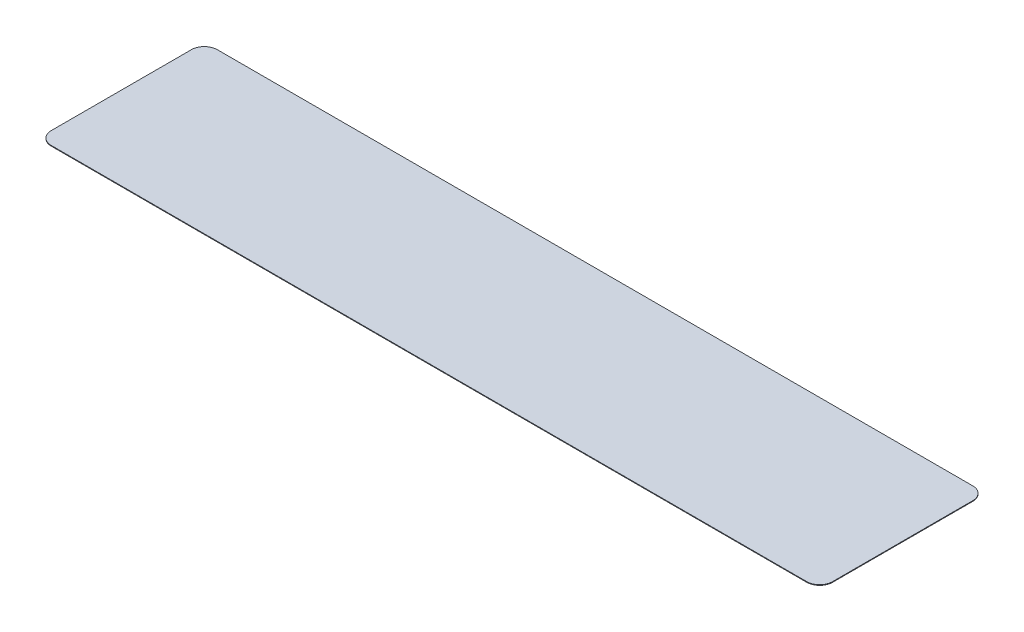
ISO-10303-21;
HEADER;
FILE_DESCRIPTION(('STEP AP214'),'2;1');
FILE_NAME('part.step','',(''),(''),'','','');
FILE_SCHEMA(('AUTOMOTIVE_DESIGN { 1 0 10303 214 1 1 1 1 }'));
ENDSEC;
DATA;
#1=APPLICATION_CONTEXT('core data for automotive mechanical design processes');
#2=APPLICATION_PROTOCOL_DEFINITION('international standard','automotive_design',2000,#1);
#3=PRODUCT_CONTEXT('',#1,'mechanical');
#4=PRODUCT('Part','Part','',(#3));
#5=PRODUCT_RELATED_PRODUCT_CATEGORY('part','',(#4));
#6=PRODUCT_DEFINITION_FORMATION('','',#4);
#7=PRODUCT_DEFINITION_CONTEXT('part definition',#1,'design');
#8=PRODUCT_DEFINITION('design','',#6,#7);
#9=PRODUCT_DEFINITION_SHAPE('','',#8);
#10=(LENGTH_UNIT() NAMED_UNIT(*) SI_UNIT(.MILLI.,.METRE.));
#11=(NAMED_UNIT(*) PLANE_ANGLE_UNIT() SI_UNIT($,.RADIAN.));
#12=(NAMED_UNIT(*) SI_UNIT($,.STERADIAN.) SOLID_ANGLE_UNIT());
#13=UNCERTAINTY_MEASURE_WITH_UNIT(LENGTH_MEASURE(1.E-05),#10,'distance_accuracy_value','');
#14=(GEOMETRIC_REPRESENTATION_CONTEXT(3) GLOBAL_UNCERTAINTY_ASSIGNED_CONTEXT((#13)) GLOBAL_UNIT_ASSIGNED_CONTEXT((#10,
#11,#12)) REPRESENTATION_CONTEXT('',''));
#15=CARTESIAN_POINT('',(0.,0.,0.));
#16=DIRECTION('',(0.,0.,1.));
#17=DIRECTION('',(1.,0.,0.));
#18=AXIS2_PLACEMENT_3D('',#15,#16,#17);
#19=CARTESIAN_POINT('',(-44.5135,0.0762,-8.25499999999998));
#20=DIRECTION('',(0.,-1.,0.));
#21=DIRECTION('',(0.,0.,-1.));
#22=AXIS2_PLACEMENT_3D('',#19,#20,#21);
#23=CYLINDRICAL_SURFACE('',#22,1.52399999999999);
#24=CARTESIAN_POINT('',(-44.5135,0.,-8.25499999999998));
#25=DIRECTION('',(0.,1.,0.));
#26=DIRECTION('',(0.,0.,1.));
#27=AXIS2_PLACEMENT_3D('',#24,#25,#26);
#28=CIRCLE('',#27,1.52399999999999);
#29=CARTESIAN_POINT('',(-44.5135,0.,-9.77899999999998));
#30=VERTEX_POINT('',#29);
#31=CARTESIAN_POINT('',(-46.0375,0.,-8.25499999999998));
#32=VERTEX_POINT('',#31);
#33=EDGE_CURVE('E128',#30,#32,#28,.T.);
#34=ORIENTED_EDGE('',*,*,#33,.T.);
#35=DIRECTION('',(0.,-1.,0.));
#36=VECTOR('',#35,1.);
#37=CARTESIAN_POINT('',(-46.0375,0.0762,-8.25499999999998));
#38=LINE('',#37,#36);
#39=CARTESIAN_POINT('',(-46.0375,0.0762,-8.25499999999998));
#40=VERTEX_POINT('',#39);
#41=EDGE_CURVE('E11',#40,#32,#38,.T.);
#42=ORIENTED_EDGE('',*,*,#41,.F.);
#43=CARTESIAN_POINT('',(-44.5135,0.0762,-8.25499999999998));
#44=DIRECTION('',(0.,1.,0.));
#45=DIRECTION('',(0.,0.,1.));
#46=AXIS2_PLACEMENT_3D('',#43,#44,#45);
#47=CIRCLE('',#46,1.52399999999999);
#48=CARTESIAN_POINT('',(-44.5135,0.0762,-9.77899999999998));
#49=VERTEX_POINT('',#48);
#50=EDGE_CURVE('E142',#49,#40,#47,.T.);
#51=ORIENTED_EDGE('',*,*,#50,.F.);
#52=DIRECTION('',(0.,-1.,0.));
#53=VECTOR('',#52,1.);
#54=CARTESIAN_POINT('',(-44.5135,0.0762,-9.77899999999998));
#55=LINE('',#54,#53);
#56=EDGE_CURVE('E124',#49,#30,#55,.T.);
#57=ORIENTED_EDGE('',*,*,#56,.T.);
#58=EDGE_LOOP('',(#34,#42,#51,#57));
#59=FACE_BOUND('',#58,.T.);
#60=ADVANCED_FACE('F32',(#59),#23,.T.);
#61=CARTESIAN_POINT('',(-46.0375,0.0762,-8.25499999999998));
#62=DIRECTION('',(1.,0.,0.));
#63=DIRECTION('',(0.,0.,-1.));
#64=AXIS2_PLACEMENT_3D('',#61,#62,#63);
#65=PLANE('',#64);
#66=DIRECTION('',(0.,0.,1.));
#67=VECTOR('',#66,1.);
#68=CARTESIAN_POINT('',(-46.0375,0.,-8.25499999999998));
#69=LINE('',#68,#67);
#70=CARTESIAN_POINT('',(-46.0375,0.,8.255));
#71=VERTEX_POINT('',#70);
#72=EDGE_CURVE('E131',#32,#71,#69,.T.);
#73=ORIENTED_EDGE('',*,*,#72,.T.);
#74=DIRECTION('',(0.,-1.,0.));
#75=VECTOR('',#74,1.);
#76=CARTESIAN_POINT('',(-46.0375,0.0762,8.255));
#77=LINE('',#76,#75);
#78=CARTESIAN_POINT('',(-46.0375,0.0762,8.255));
#79=VERTEX_POINT('',#78);
#80=EDGE_CURVE('E40',#79,#71,#77,.T.);
#81=ORIENTED_EDGE('',*,*,#80,.F.);
#82=DIRECTION('',(0.,0.,1.));
#83=VECTOR('',#82,1.);
#84=CARTESIAN_POINT('',(-46.0375,0.0762,-8.25499999999998));
#85=LINE('',#84,#83);
#86=EDGE_CURVE('E91',#40,#79,#85,.T.);
#87=ORIENTED_EDGE('',*,*,#86,.F.);
#88=ORIENTED_EDGE('',*,*,#41,.T.);
#89=EDGE_LOOP('',(#73,#81,#87,#88));
#90=FACE_BOUND('',#89,.T.);
#91=ADVANCED_FACE('F177',(#90),#65,.F.);
#92=CARTESIAN_POINT('',(-44.5135,0.0762,8.255));
#93=DIRECTION('',(0.,-1.,0.));
#94=DIRECTION('',(0.,0.,-1.));
#95=AXIS2_PLACEMENT_3D('',#92,#93,#94);
#96=CYLINDRICAL_SURFACE('',#95,1.52399999999998);
#97=CARTESIAN_POINT('',(-44.5135,0.,8.255));
#98=DIRECTION('',(0.,1.,0.));
#99=DIRECTION('',(0.,0.,-1.));
#100=AXIS2_PLACEMENT_3D('',#97,#98,#99);
#101=CIRCLE('',#100,1.52399999999998);
#102=CARTESIAN_POINT('',(-44.5135,0.,9.779));
#103=VERTEX_POINT('',#102);
#104=EDGE_CURVE('E133',#71,#103,#101,.T.);
#105=ORIENTED_EDGE('',*,*,#104,.T.);
#106=DIRECTION('',(0.,-1.,0.));
#107=VECTOR('',#106,1.);
#108=CARTESIAN_POINT('',(-44.5135,0.0762,9.779));
#109=LINE('',#108,#107);
#110=CARTESIAN_POINT('',(-44.5135,0.0762,9.779));
#111=VERTEX_POINT('',#110);
#112=EDGE_CURVE('E149',#111,#103,#109,.T.);
#113=ORIENTED_EDGE('',*,*,#112,.F.);
#114=CARTESIAN_POINT('',(-44.5135,0.0762,8.255));
#115=DIRECTION('',(0.,1.,0.));
#116=DIRECTION('',(0.,0.,-1.));
#117=AXIS2_PLACEMENT_3D('',#114,#115,#116);
#118=CIRCLE('',#117,1.52399999999998);
#119=EDGE_CURVE('E157',#79,#111,#118,.T.);
#120=ORIENTED_EDGE('',*,*,#119,.F.);
#121=ORIENTED_EDGE('',*,*,#80,.T.);
#122=EDGE_LOOP('',(#105,#113,#120,#121));
#123=FACE_BOUND('',#122,.T.);
#124=ADVANCED_FACE('F155',(#123),#96,.T.);
#125=CARTESIAN_POINT('',(-44.5135,0.0762,9.779));
#126=DIRECTION('',(0.,0.,-1.));
#127=DIRECTION('',(-1.,0.,0.));
#128=AXIS2_PLACEMENT_3D('',#125,#126,#127);
#129=PLANE('',#128);
#130=DIRECTION('',(1.,0.,0.));
#131=VECTOR('',#130,1.);
#132=CARTESIAN_POINT('',(-44.5135,0.,9.779));
#133=LINE('',#132,#131);
#134=CARTESIAN_POINT('',(44.5135,0.,9.77899999999997));
#135=VERTEX_POINT('',#134);
#136=EDGE_CURVE('E135',#103,#135,#133,.T.);
#137=ORIENTED_EDGE('',*,*,#136,.T.);
#138=DIRECTION('',(0.,-1.,0.));
#139=VECTOR('',#138,1.);
#140=CARTESIAN_POINT('',(44.5135,0.0762,9.77899999999997));
#141=LINE('',#140,#139);
#142=CARTESIAN_POINT('',(44.5135,0.0762,9.77899999999997));
#143=VERTEX_POINT('',#142);
#144=EDGE_CURVE('E146',#143,#135,#141,.T.);
#145=ORIENTED_EDGE('',*,*,#144,.F.);
#146=DIRECTION('',(1.,0.,0.));
#147=VECTOR('',#146,1.);
#148=CARTESIAN_POINT('',(-44.5135,0.0762,9.779));
#149=LINE('',#148,#147);
#150=EDGE_CURVE('E169',#111,#143,#149,.T.);
#151=ORIENTED_EDGE('',*,*,#150,.F.);
#152=ORIENTED_EDGE('',*,*,#112,.T.);
#153=EDGE_LOOP('',(#137,#145,#151,#152));
#154=FACE_BOUND('',#153,.T.);
#155=ADVANCED_FACE('F165',(#154),#129,.F.);
#156=CARTESIAN_POINT('',(44.5135,0.0762,8.25499999999999));
#157=DIRECTION('',(0.,-1.,0.));
#158=DIRECTION('',(0.,0.,-1.));
#159=AXIS2_PLACEMENT_3D('',#156,#157,#158);
#160=CYLINDRICAL_SURFACE('',#159,1.52399999999998);
#161=CARTESIAN_POINT('',(44.5135,0.,8.25499999999999));
#162=DIRECTION('',(0.,1.,0.));
#163=DIRECTION('',(0.,0.,-1.));
#164=AXIS2_PLACEMENT_3D('',#161,#162,#163);
#165=CIRCLE('',#164,1.52399999999998);
#166=CARTESIAN_POINT('',(46.0375,0.,8.25499999999999));
#167=VERTEX_POINT('',#166);
#168=EDGE_CURVE('E137',#135,#167,#165,.T.);
#169=ORIENTED_EDGE('',*,*,#168,.T.);
#170=DIRECTION('',(0.,-1.,0.));
#171=VECTOR('',#170,1.);
#172=CARTESIAN_POINT('',(46.0375,0.0762,8.25499999999999));
#173=LINE('',#172,#171);
#174=CARTESIAN_POINT('',(46.0375,0.0762,8.25499999999999));
#175=VERTEX_POINT('',#174);
#176=EDGE_CURVE('E119',#175,#167,#173,.T.);
#177=ORIENTED_EDGE('',*,*,#176,.F.);
#178=CARTESIAN_POINT('',(44.5135,0.0762,8.25499999999999));
#179=DIRECTION('',(0.,1.,0.));
#180=DIRECTION('',(0.,0.,-1.));
#181=AXIS2_PLACEMENT_3D('',#178,#179,#180);
#182=CIRCLE('',#181,1.52399999999998);
#183=EDGE_CURVE('E110',#143,#175,#182,.T.);
#184=ORIENTED_EDGE('',*,*,#183,.F.);
#185=ORIENTED_EDGE('',*,*,#144,.T.);
#186=EDGE_LOOP('',(#169,#177,#184,#185));
#187=FACE_BOUND('',#186,.T.);
#188=ADVANCED_FACE('F168',(#187),#160,.T.);
#189=CARTESIAN_POINT('',(46.0375,0.0762,-8.25499999999999));
#190=DIRECTION('',(-1.,0.,0.));
#191=DIRECTION('',(0.,0.,1.));
#192=AXIS2_PLACEMENT_3D('',#189,#190,#191);
#193=PLANE('',#192);
#194=DIRECTION('',(0.,0.,-1.));
#195=VECTOR('',#194,1.);
#196=CARTESIAN_POINT('',(46.0375,0.,-8.25499999999999));
#197=LINE('',#196,#195);
#198=CARTESIAN_POINT('',(46.0375,0.,-8.25499999999999));
#199=VERTEX_POINT('',#198);
#200=EDGE_CURVE('E118',#167,#199,#197,.T.);
#201=ORIENTED_EDGE('',*,*,#200,.T.);
#202=DIRECTION('',(0.,-1.,0.));
#203=VECTOR('',#202,1.);
#204=CARTESIAN_POINT('',(46.0375,0.0762,-8.25499999999999));
#205=LINE('',#204,#203);
#206=CARTESIAN_POINT('',(46.0375,0.0762,-8.25499999999999));
#207=VERTEX_POINT('',#206);
#208=EDGE_CURVE('E115',#207,#199,#205,.T.);
#209=ORIENTED_EDGE('',*,*,#208,.F.);
#210=DIRECTION('',(0.,0.,-1.));
#211=VECTOR('',#210,1.);
#212=CARTESIAN_POINT('',(46.0375,0.0762,-8.25499999999999));
#213=LINE('',#212,#211);
#214=EDGE_CURVE('E104',#175,#207,#213,.T.);
#215=ORIENTED_EDGE('',*,*,#214,.F.);
#216=ORIENTED_EDGE('',*,*,#176,.T.);
#217=EDGE_LOOP('',(#201,#209,#215,#216));
#218=FACE_BOUND('',#217,.T.);
#219=ADVANCED_FACE('F116',(#218),#193,.F.);
#220=CARTESIAN_POINT('',(44.5135,0.0762,-8.25499999999999));
#221=DIRECTION('',(0.,-1.,0.));
#222=DIRECTION('',(0.,0.,-1.));
#223=AXIS2_PLACEMENT_3D('',#220,#221,#222);
#224=CYLINDRICAL_SURFACE('',#223,1.52399999999999);
#225=CARTESIAN_POINT('',(44.5135,0.,-8.25499999999999));
#226=DIRECTION('',(0.,1.,0.));
#227=DIRECTION('',(0.,0.,1.));
#228=AXIS2_PLACEMENT_3D('',#225,#226,#227);
#229=CIRCLE('',#228,1.52399999999999);
#230=CARTESIAN_POINT('',(44.5135,0.,-9.77899999999999));
#231=VERTEX_POINT('',#230);
#232=EDGE_CURVE('E77',#199,#231,#229,.T.);
#233=ORIENTED_EDGE('',*,*,#232,.T.);
#234=DIRECTION('',(0.,-1.,0.));
#235=VECTOR('',#234,1.);
#236=CARTESIAN_POINT('',(44.5135,0.0762,-9.77899999999999));
#237=LINE('',#236,#235);
#238=CARTESIAN_POINT('',(44.5135,0.0762,-9.77899999999999));
#239=VERTEX_POINT('',#238);
#240=EDGE_CURVE('E120',#239,#231,#237,.T.);
#241=ORIENTED_EDGE('',*,*,#240,.F.);
#242=CARTESIAN_POINT('',(44.5135,0.0762,-8.25499999999999));
#243=DIRECTION('',(0.,1.,0.));
#244=DIRECTION('',(0.,0.,1.));
#245=AXIS2_PLACEMENT_3D('',#242,#243,#244);
#246=CIRCLE('',#245,1.52399999999999);
#247=EDGE_CURVE('E108',#207,#239,#246,.T.);
#248=ORIENTED_EDGE('',*,*,#247,.F.);
#249=ORIENTED_EDGE('',*,*,#208,.T.);
#250=EDGE_LOOP('',(#233,#241,#248,#249));
#251=FACE_BOUND('',#250,.T.);
#252=ADVANCED_FACE('F122',(#251),#224,.T.);
#253=CARTESIAN_POINT('',(-44.5135,0.0762,-9.77899999999998));
#254=DIRECTION('',(0.,0.,1.));
#255=DIRECTION('',(1.,0.,0.));
#256=AXIS2_PLACEMENT_3D('',#253,#254,#255);
#257=PLANE('',#256);
#258=DIRECTION('',(-1.,0.,0.));
#259=VECTOR('',#258,1.);
#260=CARTESIAN_POINT('',(-44.5135,0.,-9.77899999999998));
#261=LINE('',#260,#259);
#262=EDGE_CURVE('E83',#231,#30,#261,.T.);
#263=ORIENTED_EDGE('',*,*,#262,.T.);
#264=ORIENTED_EDGE('',*,*,#56,.F.);
#265=DIRECTION('',(-1.,0.,0.));
#266=VECTOR('',#265,1.);
#267=CARTESIAN_POINT('',(-44.5135,0.0762,-9.77899999999998));
#268=LINE('',#267,#266);
#269=EDGE_CURVE('E48',#239,#49,#268,.T.);
#270=ORIENTED_EDGE('',*,*,#269,.F.);
#271=ORIENTED_EDGE('',*,*,#240,.T.);
#272=EDGE_LOOP('',(#263,#264,#270,#271));
#273=FACE_BOUND('',#272,.T.);
#274=ADVANCED_FACE('F193',(#273),#257,.F.);
#275=CARTESIAN_POINT('',(-44.5135,0.0762,-8.25499999999998));
#276=DIRECTION('',(0.,1.,0.));
#277=DIRECTION('',(0.,0.,1.));
#278=AXIS2_PLACEMENT_3D('',#275,#276,#277);
#279=PLANE('',#278);
#280=ORIENTED_EDGE('',*,*,#50,.T.);
#281=ORIENTED_EDGE('',*,*,#86,.T.);
#282=ORIENTED_EDGE('',*,*,#119,.T.);
#283=ORIENTED_EDGE('',*,*,#150,.T.);
#284=ORIENTED_EDGE('',*,*,#183,.T.);
#285=ORIENTED_EDGE('',*,*,#214,.T.);
#286=ORIENTED_EDGE('',*,*,#247,.T.);
#287=ORIENTED_EDGE('',*,*,#269,.T.);
#288=EDGE_LOOP('',(#280,#281,#282,#283,#284,#285,#286,#287));
#289=FACE_BOUND('',#288,.T.);
#290=ADVANCED_FACE('F106',(#289),#279,.T.);
#291=CARTESIAN_POINT('',(-44.5135,0.,-8.25499999999998));
#292=DIRECTION('',(0.,1.,0.));
#293=DIRECTION('',(0.,0.,1.));
#294=AXIS2_PLACEMENT_3D('',#291,#292,#293);
#295=PLANE('',#294);
#296=ORIENTED_EDGE('',*,*,#33,.F.);
#297=ORIENTED_EDGE('',*,*,#262,.F.);
#298=ORIENTED_EDGE('',*,*,#232,.F.);
#299=ORIENTED_EDGE('',*,*,#200,.F.);
#300=ORIENTED_EDGE('',*,*,#168,.F.);
#301=ORIENTED_EDGE('',*,*,#136,.F.);
#302=ORIENTED_EDGE('',*,*,#104,.F.);
#303=ORIENTED_EDGE('',*,*,#72,.F.);
#304=EDGE_LOOP('',(#296,#297,#298,#299,#300,#301,#302,#303));
#305=FACE_BOUND('',#304,.T.);
#306=ADVANCED_FACE('F161',(#305),#295,.F.);
#307=CLOSED_SHELL('',(#60,#91,#124,#155,#188,#219,#252,#274,#290,#306));
#308=MANIFOLD_SOLID_BREP('B2',#307);
#309=ADVANCED_BREP_SHAPE_REPRESENTATION('',(#18,#308),#14);
#310=SHAPE_DEFINITION_REPRESENTATION(#9,#309);
ENDSEC;
END-ISO-10303-21;
